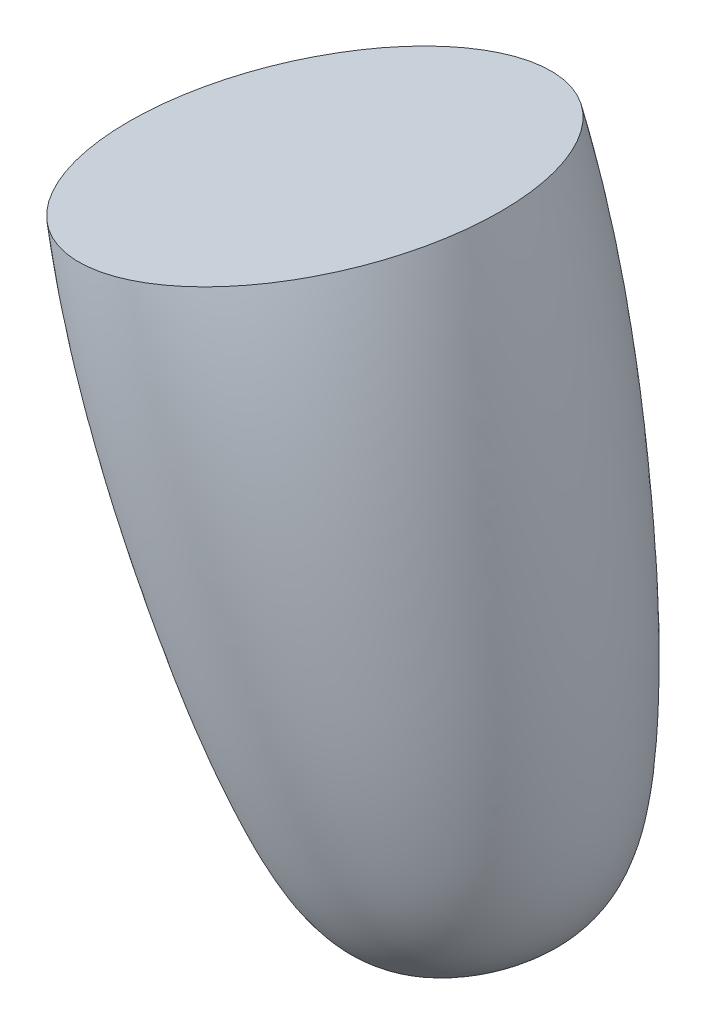
ISO-10303-21;
HEADER;
FILE_DESCRIPTION(('STEP AP214'),'2;1');
FILE_NAME('part.step','',(''),(''),'','','');
FILE_SCHEMA(('AUTOMOTIVE_DESIGN { 1 0 10303 214 1 1 1 1 }'));
ENDSEC;
DATA;
#1=APPLICATION_CONTEXT('core data for automotive mechanical design processes');
#2=APPLICATION_PROTOCOL_DEFINITION('international standard','automotive_design',2000,#1);
#3=PRODUCT_CONTEXT('',#1,'mechanical');
#4=PRODUCT('Part','Part','',(#3));
#5=PRODUCT_RELATED_PRODUCT_CATEGORY('part','',(#4));
#6=PRODUCT_DEFINITION_FORMATION('','',#4);
#7=PRODUCT_DEFINITION_CONTEXT('part definition',#1,'design');
#8=PRODUCT_DEFINITION('design','',#6,#7);
#9=PRODUCT_DEFINITION_SHAPE('','',#8);
#10=(LENGTH_UNIT() NAMED_UNIT(*) SI_UNIT(.MILLI.,.METRE.));
#11=(NAMED_UNIT(*) PLANE_ANGLE_UNIT() SI_UNIT($,.RADIAN.));
#12=(NAMED_UNIT(*) SI_UNIT($,.STERADIAN.) SOLID_ANGLE_UNIT());
#13=UNCERTAINTY_MEASURE_WITH_UNIT(LENGTH_MEASURE(1.E-05),#10,'distance_accuracy_value','');
#14=(GEOMETRIC_REPRESENTATION_CONTEXT(3) GLOBAL_UNCERTAINTY_ASSIGNED_CONTEXT((#13)) GLOBAL_UNIT_ASSIGNED_CONTEXT((#10,
#11,#12)) REPRESENTATION_CONTEXT('',''));
#15=CARTESIAN_POINT('',(0.,0.,0.));
#16=DIRECTION('',(0.,0.,1.));
#17=DIRECTION('',(1.,0.,0.));
#18=AXIS2_PLACEMENT_3D('',#15,#16,#17);
#19=CARTESIAN_POINT('',(-123.354184703924,35.9751267586728,0.));
#20=CARTESIAN_POINT('',(-121.166384307363,25.7462166293572,0.));
#21=CARTESIAN_POINT('',(-115.745033918661,10.8575338558546,0.));
#22=CARTESIAN_POINT('',(-106.127875764861,-9.39151547856051,0.));
#23=CARTESIAN_POINT('',(-97.5268100312961,-20.790890561842,0.));
#24=CARTESIAN_POINT('',(-88.3931064326641,-16.3576832758633,0.));
#25=B_SPLINE_CURVE_WITH_KNOTS('',3,(#19,#20,#21,#22,#23,#24),.UNSPECIFIED.,.F.,.F.,(4,1,1,4),
(0.,0.457844157731501,0.674367665087235,1.),.UNSPECIFIED.);
#26=CARTESIAN_POINT('',(-105.106178469312,41.2675995702782,0.));
#27=DIRECTION('',(-0.278551200610807,0.960421380769024,0.));
#28=AXIS1_PLACEMENT('',#26,#27);
#29=SURFACE_OF_REVOLUTION('',#25,#28);
#30=CARTESIAN_POINT('',(-88.3931064326641,-16.3576832758633,0.));
#31=VERTEX_POINT('',#30);
#32=VERTEX_LOOP('',#31);
#33=FACE_BOUND('',#32,.T.);
#34=CARTESIAN_POINT('',(-105.106178469312,41.2675995702782,0.));
#35=DIRECTION('',(-0.278551200610807,0.960421380769024,0.));
#36=DIRECTION('',(-0.960421380769024,-0.278551200610807,0.));
#37=AXIS2_PLACEMENT_3D('',#34,#35,#36);
#38=CIRCLE('',#37,19.);
#39=CARTESIAN_POINT('',(-123.354184703924,35.9751267586728,0.));
#40=VERTEX_POINT('',#39);
#41=EDGE_CURVE('E11',#40,#40,#38,.T.);
#42=ORIENTED_EDGE('',*,*,#41,.F.);
#43=EDGE_LOOP('',(#42));
#44=FACE_BOUND('',#43,.T.);
#45=ADVANCED_FACE('F33',(#33,#44),#29,.F.);
#46=CARTESIAN_POINT('',(-123.354184703924,35.9751267586728,0.));
#47=DIRECTION('',(-0.278551200610807,0.960421380769024,0.));
#48=DIRECTION('',(-0.960421380769024,-0.278551200610807,0.));
#49=AXIS2_PLACEMENT_3D('',#46,#47,#48);
#50=PLANE('',#49);
#51=ORIENTED_EDGE('',*,*,#41,.T.);
#52=EDGE_LOOP('',(#51));
#53=FACE_BOUND('',#52,.T.);
#54=ADVANCED_FACE('F43',(#53),#50,.T.);
#55=CLOSED_SHELL('',(#45,#54));
#56=MANIFOLD_SOLID_BREP('B2',#55);
#57=ADVANCED_BREP_SHAPE_REPRESENTATION('',(#18,#56),#14);
#58=SHAPE_DEFINITION_REPRESENTATION(#9,#57);
ENDSEC;
END-ISO-10303-21;
